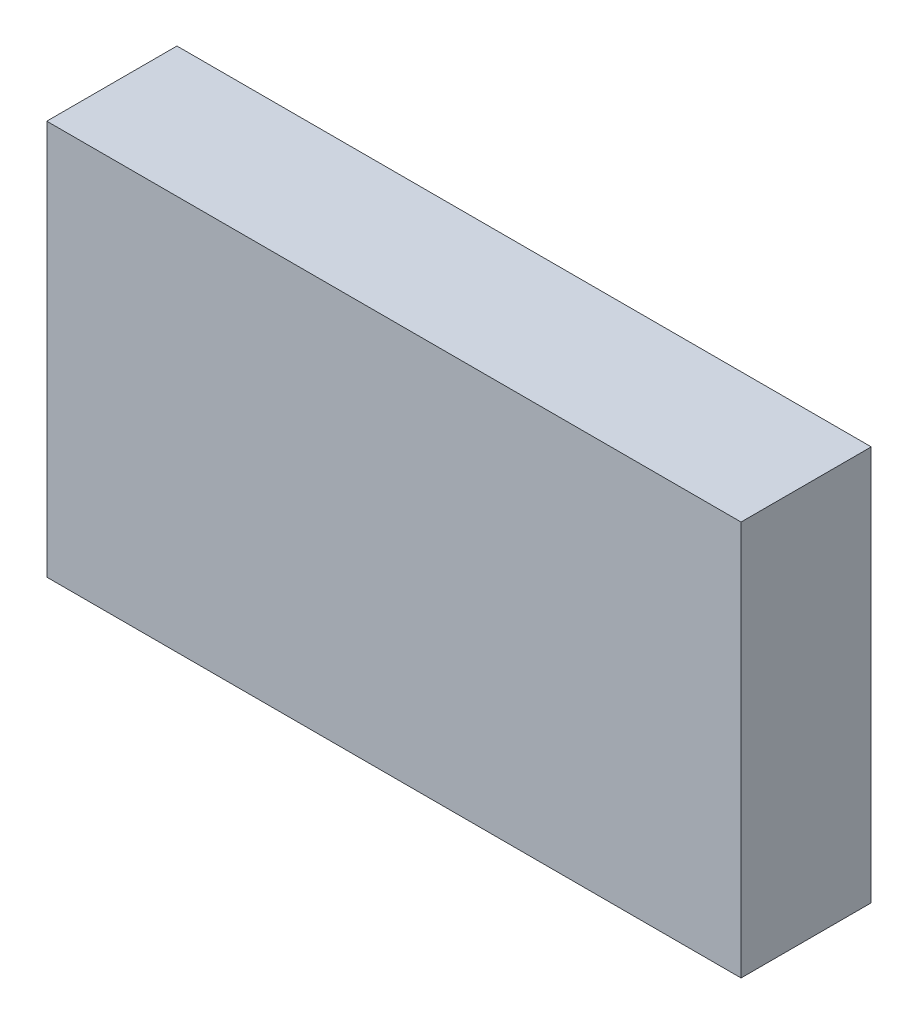
ISO-10303-21;
HEADER;
FILE_DESCRIPTION(('STEP AP214'),'2;1');
FILE_NAME('part.step','',(''),(''),'','','');
FILE_SCHEMA(('AUTOMOTIVE_DESIGN { 1 0 10303 214 1 1 1 1 }'));
ENDSEC;
DATA;
#1=APPLICATION_CONTEXT('core data for automotive mechanical design processes');
#2=APPLICATION_PROTOCOL_DEFINITION('international standard','automotive_design',2000,#1);
#3=PRODUCT_CONTEXT('',#1,'mechanical');
#4=PRODUCT('Part','Part','',(#3));
#5=PRODUCT_RELATED_PRODUCT_CATEGORY('part','',(#4));
#6=PRODUCT_DEFINITION_FORMATION('','',#4);
#7=PRODUCT_DEFINITION_CONTEXT('part definition',#1,'design');
#8=PRODUCT_DEFINITION('design','',#6,#7);
#9=PRODUCT_DEFINITION_SHAPE('','',#8);
#10=(LENGTH_UNIT() NAMED_UNIT(*) SI_UNIT(.MILLI.,.METRE.));
#11=(NAMED_UNIT(*) PLANE_ANGLE_UNIT() SI_UNIT($,.RADIAN.));
#12=(NAMED_UNIT(*) SI_UNIT($,.STERADIAN.) SOLID_ANGLE_UNIT());
#13=UNCERTAINTY_MEASURE_WITH_UNIT(LENGTH_MEASURE(1.E-05),#10,'distance_accuracy_value','');
#14=(GEOMETRIC_REPRESENTATION_CONTEXT(3) GLOBAL_UNCERTAINTY_ASSIGNED_CONTEXT((#13)) GLOBAL_UNIT_ASSIGNED_CONTEXT((#10,
#11,#12)) REPRESENTATION_CONTEXT('',''));
#15=CARTESIAN_POINT('',(0.,0.,0.));
#16=DIRECTION('',(0.,0.,1.));
#17=DIRECTION('',(1.,0.,0.));
#18=AXIS2_PLACEMENT_3D('',#15,#16,#17);
#19=CARTESIAN_POINT('',(-80.,-45.5,30.));
#20=DIRECTION('',(1.,0.,0.));
#21=DIRECTION('',(0.,1.,0.));
#22=AXIS2_PLACEMENT_3D('',#19,#20,#21);
#23=PLANE('',#22);
#24=DIRECTION('',(0.,-1.,0.));
#25=VECTOR('',#24,1.);
#26=CARTESIAN_POINT('',(-80.,-45.5,0.));
#27=LINE('',#26,#25);
#28=CARTESIAN_POINT('',(-80.,45.5,0.));
#29=VERTEX_POINT('',#28);
#30=CARTESIAN_POINT('',(-80.,-45.5,0.));
#31=VERTEX_POINT('',#30);
#32=EDGE_CURVE('E95',#29,#31,#27,.T.);
#33=ORIENTED_EDGE('',*,*,#32,.T.);
#34=DIRECTION('',(0.,0.,-1.));
#35=VECTOR('',#34,1.);
#36=CARTESIAN_POINT('',(-80.,-45.5,30.));
#37=LINE('',#36,#35);
#38=CARTESIAN_POINT('',(-80.,-45.5,30.));
#39=VERTEX_POINT('',#38);
#40=EDGE_CURVE('E11',#39,#31,#37,.T.);
#41=ORIENTED_EDGE('',*,*,#40,.F.);
#42=DIRECTION('',(0.,-1.,0.));
#43=VECTOR('',#42,1.);
#44=CARTESIAN_POINT('',(-80.,-45.5,30.));
#45=LINE('',#44,#43);
#46=CARTESIAN_POINT('',(-80.,45.5,30.));
#47=VERTEX_POINT('',#46);
#48=EDGE_CURVE('E83',#47,#39,#45,.T.);
#49=ORIENTED_EDGE('',*,*,#48,.F.);
#50=DIRECTION('',(0.,0.,-1.));
#51=VECTOR('',#50,1.);
#52=CARTESIAN_POINT('',(-80.,45.5,30.));
#53=LINE('',#52,#51);
#54=EDGE_CURVE('E91',#47,#29,#53,.T.);
#55=ORIENTED_EDGE('',*,*,#54,.T.);
#56=EDGE_LOOP('',(#33,#41,#49,#55));
#57=FACE_BOUND('',#56,.T.);
#58=ADVANCED_FACE('F32',(#57),#23,.F.);
#59=CARTESIAN_POINT('',(80.,-45.5,30.));
#60=DIRECTION('',(0.,1.,0.));
#61=DIRECTION('',(-1.,0.,0.));
#62=AXIS2_PLACEMENT_3D('',#59,#60,#61);
#63=PLANE('',#62);
#64=DIRECTION('',(1.,0.,0.));
#65=VECTOR('',#64,1.);
#66=CARTESIAN_POINT('',(80.,-45.5,0.));
#67=LINE('',#66,#65);
#68=CARTESIAN_POINT('',(80.,-45.5,0.));
#69=VERTEX_POINT('',#68);
#70=EDGE_CURVE('E87',#31,#69,#67,.T.);
#71=ORIENTED_EDGE('',*,*,#70,.T.);
#72=DIRECTION('',(0.,0.,-1.));
#73=VECTOR('',#72,1.);
#74=CARTESIAN_POINT('',(80.,-45.5,30.));
#75=LINE('',#74,#73);
#76=CARTESIAN_POINT('',(80.,-45.5,30.));
#77=VERTEX_POINT('',#76);
#78=EDGE_CURVE('E40',#77,#69,#75,.T.);
#79=ORIENTED_EDGE('',*,*,#78,.F.);
#80=DIRECTION('',(1.,0.,0.));
#81=VECTOR('',#80,1.);
#82=CARTESIAN_POINT('',(80.,-45.5,30.));
#83=LINE('',#82,#81);
#84=EDGE_CURVE('E78',#39,#77,#83,.T.);
#85=ORIENTED_EDGE('',*,*,#84,.F.);
#86=ORIENTED_EDGE('',*,*,#40,.T.);
#87=EDGE_LOOP('',(#71,#79,#85,#86));
#88=FACE_BOUND('',#87,.T.);
#89=ADVANCED_FACE('F86',(#88),#63,.F.);
#90=CARTESIAN_POINT('',(80.,-45.5,30.));
#91=DIRECTION('',(-1.,0.,0.));
#92=DIRECTION('',(0.,0.,1.));
#93=AXIS2_PLACEMENT_3D('',#90,#91,#92);
#94=PLANE('',#93);
#95=DIRECTION('',(0.,1.,0.));
#96=VECTOR('',#95,1.);
#97=CARTESIAN_POINT('',(80.,-45.5,0.));
#98=LINE('',#97,#96);
#99=CARTESIAN_POINT('',(80.,45.5,0.));
#100=VERTEX_POINT('',#99);
#101=EDGE_CURVE('E65',#69,#100,#98,.T.);
#102=ORIENTED_EDGE('',*,*,#101,.T.);
#103=DIRECTION('',(0.,0.,-1.));
#104=VECTOR('',#103,1.);
#105=CARTESIAN_POINT('',(80.,45.5,30.));
#106=LINE('',#105,#104);
#107=CARTESIAN_POINT('',(80.,45.5,30.));
#108=VERTEX_POINT('',#107);
#109=EDGE_CURVE('E88',#108,#100,#106,.T.);
#110=ORIENTED_EDGE('',*,*,#109,.F.);
#111=DIRECTION('',(0.,1.,0.));
#112=VECTOR('',#111,1.);
#113=CARTESIAN_POINT('',(80.,-45.5,30.));
#114=LINE('',#113,#112);
#115=EDGE_CURVE('E81',#77,#108,#114,.T.);
#116=ORIENTED_EDGE('',*,*,#115,.F.);
#117=ORIENTED_EDGE('',*,*,#78,.T.);
#118=EDGE_LOOP('',(#102,#110,#116,#117));
#119=FACE_BOUND('',#118,.T.);
#120=ADVANCED_FACE('F89',(#119),#94,.F.);
#121=CARTESIAN_POINT('',(80.,45.5,30.));
#122=DIRECTION('',(0.,-1.,0.));
#123=DIRECTION('',(1.,0.,0.));
#124=AXIS2_PLACEMENT_3D('',#121,#122,#123);
#125=PLANE('',#124);
#126=DIRECTION('',(-1.,0.,0.));
#127=VECTOR('',#126,1.);
#128=CARTESIAN_POINT('',(80.,45.5,0.));
#129=LINE('',#128,#127);
#130=EDGE_CURVE('E71',#100,#29,#129,.T.);
#131=ORIENTED_EDGE('',*,*,#130,.T.);
#132=ORIENTED_EDGE('',*,*,#54,.F.);
#133=DIRECTION('',(-1.,0.,0.));
#134=VECTOR('',#133,1.);
#135=CARTESIAN_POINT('',(80.,45.5,30.));
#136=LINE('',#135,#134);
#137=EDGE_CURVE('E48',#108,#47,#136,.T.);
#138=ORIENTED_EDGE('',*,*,#137,.F.);
#139=ORIENTED_EDGE('',*,*,#109,.T.);
#140=EDGE_LOOP('',(#131,#132,#138,#139));
#141=FACE_BOUND('',#140,.T.);
#142=ADVANCED_FACE('F102',(#141),#125,.F.);
#143=CARTESIAN_POINT('',(0.,0.,30.));
#144=DIRECTION('',(0.,0.,1.));
#145=DIRECTION('',(1.,0.,0.));
#146=AXIS2_PLACEMENT_3D('',#143,#144,#145);
#147=PLANE('',#146);
#148=ORIENTED_EDGE('',*,*,#48,.T.);
#149=ORIENTED_EDGE('',*,*,#84,.T.);
#150=ORIENTED_EDGE('',*,*,#115,.T.);
#151=ORIENTED_EDGE('',*,*,#137,.T.);
#152=EDGE_LOOP('',(#148,#149,#150,#151));
#153=FACE_BOUND('',#152,.T.);
#154=ADVANCED_FACE('F79',(#153),#147,.T.);
#155=CARTESIAN_POINT('',(0.,0.,0.));
#156=DIRECTION('',(0.,0.,1.));
#157=DIRECTION('',(1.,0.,0.));
#158=AXIS2_PLACEMENT_3D('',#155,#156,#157);
#159=PLANE('',#158);
#160=ORIENTED_EDGE('',*,*,#32,.F.);
#161=ORIENTED_EDGE('',*,*,#130,.F.);
#162=ORIENTED_EDGE('',*,*,#101,.F.);
#163=ORIENTED_EDGE('',*,*,#70,.F.);
#164=EDGE_LOOP('',(#160,#161,#162,#163));
#165=FACE_BOUND('',#164,.T.);
#166=ADVANCED_FACE('F105',(#165),#159,.F.);
#167=CLOSED_SHELL('',(#58,#89,#120,#142,#154,#166));
#168=MANIFOLD_SOLID_BREP('B2',#167);
#169=ADVANCED_BREP_SHAPE_REPRESENTATION('',(#18,#168),#14);
#170=SHAPE_DEFINITION_REPRESENTATION(#9,#169);
ENDSEC;
END-ISO-10303-21;
